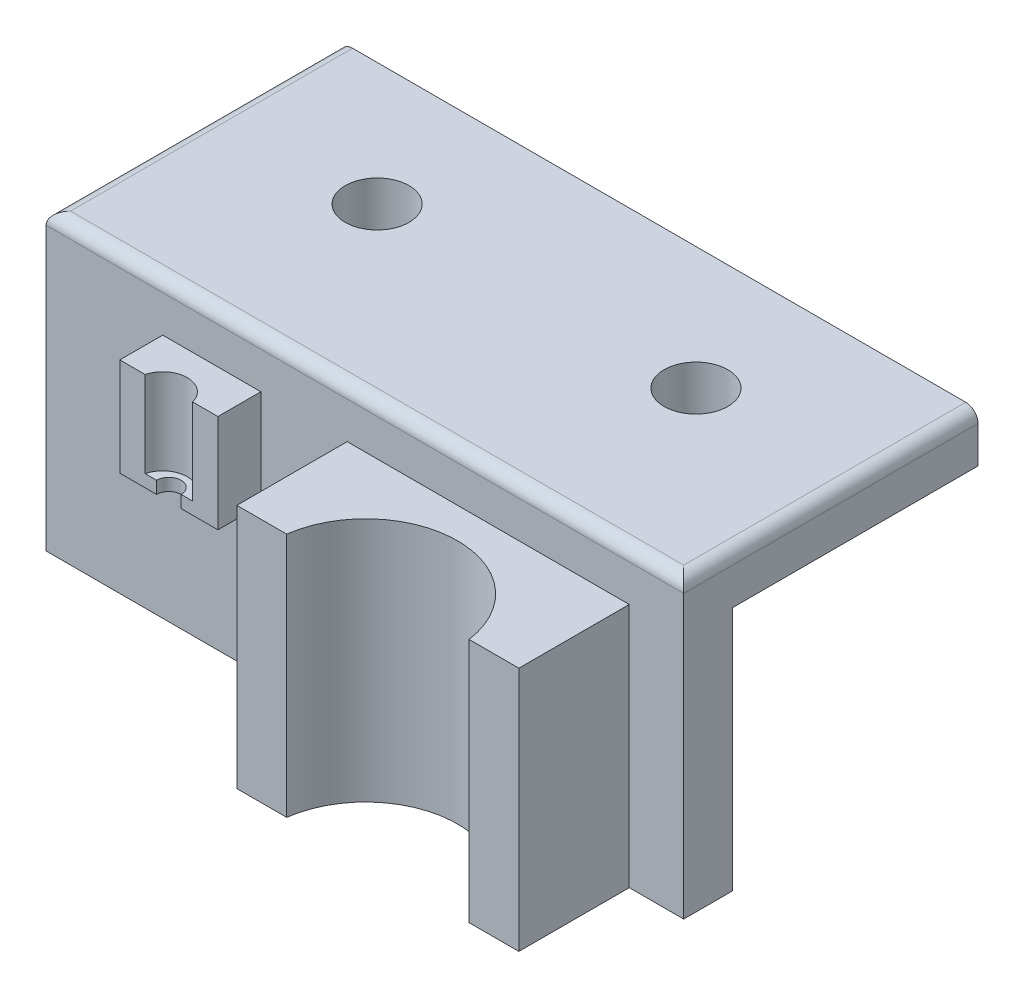
ISO-10303-21;
HEADER;
FILE_DESCRIPTION(('STEP AP214'),'2;1');
FILE_NAME('part.step','',(''),(''),'','','');
FILE_SCHEMA(('AUTOMOTIVE_DESIGN { 1 0 10303 214 1 1 1 1 }'));
ENDSEC;
DATA;
#1=APPLICATION_CONTEXT('core data for automotive mechanical design processes');
#2=APPLICATION_PROTOCOL_DEFINITION('international standard','automotive_design',2000,#1);
#3=PRODUCT_CONTEXT('',#1,'mechanical');
#4=PRODUCT('Part','Part','',(#3));
#5=PRODUCT_RELATED_PRODUCT_CATEGORY('part','',(#4));
#6=PRODUCT_DEFINITION_FORMATION('','',#4);
#7=PRODUCT_DEFINITION_CONTEXT('part definition',#1,'design');
#8=PRODUCT_DEFINITION('design','',#6,#7);
#9=PRODUCT_DEFINITION_SHAPE('','',#8);
#10=(LENGTH_UNIT() NAMED_UNIT(*) SI_UNIT(.MILLI.,.METRE.));
#11=(NAMED_UNIT(*) PLANE_ANGLE_UNIT() SI_UNIT($,.RADIAN.));
#12=(NAMED_UNIT(*) SI_UNIT($,.STERADIAN.) SOLID_ANGLE_UNIT());
#13=UNCERTAINTY_MEASURE_WITH_UNIT(LENGTH_MEASURE(1.E-05),#10,'distance_accuracy_value','');
#14=(GEOMETRIC_REPRESENTATION_CONTEXT(3) GLOBAL_UNCERTAINTY_ASSIGNED_CONTEXT((#13)) GLOBAL_UNIT_ASSIGNED_CONTEXT((#10,
#11,#12)) REPRESENTATION_CONTEXT('',''));
#15=CARTESIAN_POINT('',(0.,0.,0.));
#16=DIRECTION('',(0.,0.,1.));
#17=DIRECTION('',(1.,0.,0.));
#18=AXIS2_PLACEMENT_3D('',#15,#16,#17);
#19=CARTESIAN_POINT('',(-6.53464254801995,-28.6631016042781,7.5));
#20=DIRECTION('',(0.,0.,-1.));
#21=DIRECTION('',(-1.,0.,0.));
#22=AXIS2_PLACEMENT_3D('',#19,#20,#21);
#23=PLANE('',#22);
#24=DIRECTION('',(-1.,0.,0.));
#25=VECTOR('',#24,1.);
#26=CARTESIAN_POINT('',(-6.53464254801995,11.3368983957219,7.5));
#27=LINE('',#26,#25);
#28=CARTESIAN_POINT('',(-6.53464254801995,11.3368983957219,7.5));
#29=VERTEX_POINT('',#28);
#30=CARTESIAN_POINT('',(-8.59815087491624,11.3368983957219,7.5));
#31=VERTEX_POINT('',#30);
#32=EDGE_CURVE('E366',#29,#31,#27,.T.);
#33=ORIENTED_EDGE('',*,*,#32,.T.);
#34=DIRECTION('',(0.,1.,0.));
#35=VECTOR('',#34,1.);
#36=CARTESIAN_POINT('',(-8.59815087491624,4.33689839572192,7.5));
#37=LINE('',#36,#35);
#38=CARTESIAN_POINT('',(-8.59815087491624,4.33689839572192,7.5));
#39=VERTEX_POINT('',#38);
#40=EDGE_CURVE('E445',#39,#31,#37,.T.);
#41=ORIENTED_EDGE('',*,*,#40,.F.);
#42=DIRECTION('',(-1.,0.,0.));
#43=VECTOR('',#42,1.);
#44=CARTESIAN_POINT('',(-10.5346425480199,4.33689839572192,7.5));
#45=LINE('',#44,#43);
#46=CARTESIAN_POINT('',(-9.53464254801995,4.33689839572192,7.5));
#47=VERTEX_POINT('',#46);
#48=EDGE_CURVE('E304',#39,#47,#45,.T.);
#49=ORIENTED_EDGE('',*,*,#48,.T.);
#50=DIRECTION('',(0.,-1.,0.));
#51=VECTOR('',#50,1.);
#52=CARTESIAN_POINT('',(-9.53464254801995,14.3368983957219,7.5));
#53=LINE('',#52,#51);
#54=CARTESIAN_POINT('',(-9.53464254801995,3.33689839572192,7.5));
#55=VERTEX_POINT('',#54);
#56=EDGE_CURVE('E329',#47,#55,#53,.T.);
#57=ORIENTED_EDGE('',*,*,#56,.T.);
#58=DIRECTION('',(-1.,0.,0.));
#59=VECTOR('',#58,1.);
#60=CARTESIAN_POINT('',(0.,3.33689839572192,7.5));
#61=LINE('',#60,#59);
#62=CARTESIAN_POINT('',(-6.53464254801995,3.33689839572193,7.5));
#63=VERTEX_POINT('',#62);
#64=EDGE_CURVE('E230',#63,#55,#61,.T.);
#65=ORIENTED_EDGE('',*,*,#64,.F.);
#66=DIRECTION('',(0.,1.,0.));
#67=VECTOR('',#66,1.);
#68=CARTESIAN_POINT('',(-6.53464254801995,-28.6631016042781,7.5));
#69=LINE('',#68,#67);
#70=EDGE_CURVE('E438',#63,#29,#69,.T.);
#71=ORIENTED_EDGE('',*,*,#70,.T.);
#72=EDGE_LOOP('',(#33,#41,#49,#57,#65,#71));
#73=FACE_BOUND('',#72,.T.);
#74=ADVANCED_FACE('F40',(#73),#23,.F.);
#75=CARTESIAN_POINT('',(23.5073612519356,15.3368983957219,14.));
#76=DIRECTION('',(-1.,0.,0.));
#77=DIRECTION('',(0.,-1.,0.));
#78=AXIS2_PLACEMENT_3D('',#75,#76,#77);
#79=PLANE('',#78);
#80=DIRECTION('',(0.,0.,-1.));
#81=VECTOR('',#80,1.);
#82=CARTESIAN_POINT('',(23.5073612519356,11.3368983957219,14.));
#83=LINE('',#82,#81);
#84=CARTESIAN_POINT('',(23.5073612519356,11.3368983957219,13.));
#85=VERTEX_POINT('',#84);
#86=CARTESIAN_POINT('',(23.5073612519356,11.3368983957219,4.));
#87=VERTEX_POINT('',#86);
#88=EDGE_CURVE('E197',#85,#87,#83,.T.);
#89=ORIENTED_EDGE('',*,*,#88,.F.);
#90=DIRECTION('',(0.,1.,0.));
#91=VECTOR('',#90,1.);
#92=CARTESIAN_POINT('',(23.5073612519356,-28.6631016042781,13.));
#93=LINE('',#92,#91);
#94=CARTESIAN_POINT('',(23.5073612519356,-8.66617201959453,13.));
#95=VERTEX_POINT('',#94);
#96=EDGE_CURVE('E325',#95,#85,#93,.T.);
#97=ORIENTED_EDGE('',*,*,#96,.F.);
#98=DIRECTION('',(0.,0.,1.));
#99=VECTOR('',#98,1.);
#100=CARTESIAN_POINT('',(23.5073612519356,-8.66617201959453,4.));
#101=LINE('',#100,#99);
#102=CARTESIAN_POINT('',(23.5073612519356,-8.66617201959453,4.));
#103=VERTEX_POINT('',#102);
#104=EDGE_CURVE('E395',#103,#95,#101,.T.);
#105=ORIENTED_EDGE('',*,*,#104,.F.);
#106=DIRECTION('',(0.,1.,0.));
#107=VECTOR('',#106,1.);
#108=CARTESIAN_POINT('',(23.5073612519356,15.3368983957219,4.));
#109=LINE('',#108,#107);
#110=CARTESIAN_POINT('',(23.5073612519356,-8.66310160427808,4.));
#111=VERTEX_POINT('',#110);
#112=EDGE_CURVE('E227',#103,#111,#109,.T.);
#113=ORIENTED_EDGE('',*,*,#112,.T.);
#114=EDGE_CURVE('E217',#111,#87,#109,.T.);
#115=ORIENTED_EDGE('',*,*,#114,.T.);
#116=EDGE_LOOP('',(#89,#97,#105,#113,#115));
#117=FACE_BOUND('',#116,.T.);
#118=ADVANCED_FACE('F224',(#117),#79,.F.);
#119=CARTESIAN_POINT('',(0.507361251935578,15.3368983957219,14.));
#120=DIRECTION('',(1.,0.,0.));
#121=DIRECTION('',(0.,1.,0.));
#122=AXIS2_PLACEMENT_3D('',#119,#120,#121);
#123=PLANE('',#122);
#124=DIRECTION('',(0.,0.,-1.));
#125=VECTOR('',#124,1.);
#126=CARTESIAN_POINT('',(0.507361251935578,11.3368983957219,14.));
#127=LINE('',#126,#125);
#128=CARTESIAN_POINT('',(0.507361251935578,11.3368983957219,13.));
#129=VERTEX_POINT('',#128);
#130=CARTESIAN_POINT('',(0.507361251935578,11.3368983957219,4.));
#131=VERTEX_POINT('',#130);
#132=EDGE_CURVE('E209',#129,#131,#127,.T.);
#133=ORIENTED_EDGE('',*,*,#132,.T.);
#134=DIRECTION('',(0.,-1.,0.));
#135=VECTOR('',#134,1.);
#136=CARTESIAN_POINT('',(0.507361251935578,15.3368983957219,4.));
#137=LINE('',#136,#135);
#138=CARTESIAN_POINT('',(0.507361251935581,-8.66310160427808,4.));
#139=VERTEX_POINT('',#138);
#140=EDGE_CURVE('E219',#131,#139,#137,.T.);
#141=ORIENTED_EDGE('',*,*,#140,.T.);
#142=CARTESIAN_POINT('',(0.507361251935581,-8.66617201959453,4.));
#143=VERTEX_POINT('',#142);
#144=EDGE_CURVE('E234',#139,#143,#137,.T.);
#145=ORIENTED_EDGE('',*,*,#144,.T.);
#146=DIRECTION('',(0.,0.,-1.));
#147=VECTOR('',#146,1.);
#148=CARTESIAN_POINT('',(0.507361251935578,-8.66617201959453,13.));
#149=LINE('',#148,#147);
#150=CARTESIAN_POINT('',(0.507361251935578,-8.66617201959453,13.));
#151=VERTEX_POINT('',#150);
#152=EDGE_CURVE('E408',#151,#143,#149,.T.);
#153=ORIENTED_EDGE('',*,*,#152,.F.);
#154=DIRECTION('',(0.,1.,0.));
#155=VECTOR('',#154,1.);
#156=CARTESIAN_POINT('',(0.507361251935578,-28.6631016042781,13.));
#157=LINE('',#156,#155);
#158=EDGE_CURVE('E434',#151,#129,#157,.T.);
#159=ORIENTED_EDGE('',*,*,#158,.T.);
#160=EDGE_LOOP('',(#133,#141,#145,#153,#159));
#161=FACE_BOUND('',#160,.T.);
#162=ADVANCED_FACE('F497',(#161),#123,.F.);
#163=CARTESIAN_POINT('',(12.0073612519356,15.3368983957219,14.));
#164=DIRECTION('',(0.,-1.,0.));
#165=DIRECTION('',(0.,0.,-1.));
#166=AXIS2_PLACEMENT_3D('',#163,#164,#165);
#167=CYLINDRICAL_SURFACE('',#166,7.5);
#168=CARTESIAN_POINT('',(12.0073612519356,11.3368983957219,14.));
#169=DIRECTION('',(0.,-1.,0.));
#170=DIRECTION('',(0.,0.,-1.));
#171=AXIS2_PLACEMENT_3D('',#168,#169,#170);
#172=CIRCLE('',#171,7.5);
#173=CARTESIAN_POINT('',(4.57432687827633,11.3368983957219,13.));
#174=VERTEX_POINT('',#173);
#175=CARTESIAN_POINT('',(19.4403956255948,11.3368983957219,13.));
#176=VERTEX_POINT('',#175);
#177=EDGE_CURVE('E222',#174,#176,#172,.T.);
#178=ORIENTED_EDGE('',*,*,#177,.F.);
#179=DIRECTION('',(0.,-1.,0.));
#180=VECTOR('',#179,1.);
#181=CARTESIAN_POINT('',(4.57432687827633,15.3368983957219,13.));
#182=LINE('',#181,#180);
#183=CARTESIAN_POINT('',(4.57432687827633,-8.66617201959453,13.));
#184=VERTEX_POINT('',#183);
#185=EDGE_CURVE('E308',#174,#184,#182,.T.);
#186=ORIENTED_EDGE('',*,*,#185,.T.);
#187=CARTESIAN_POINT('',(12.0073612519356,-8.66617201959453,14.));
#188=DIRECTION('',(0.,1.,0.));
#189=DIRECTION('',(0.,0.,-1.));
#190=AXIS2_PLACEMENT_3D('',#187,#188,#189);
#191=CIRCLE('',#190,7.5);
#192=CARTESIAN_POINT('',(19.4403956255948,-8.66617201959453,13.));
#193=VERTEX_POINT('',#192);
#194=EDGE_CURVE('E401',#193,#184,#191,.T.);
#195=ORIENTED_EDGE('',*,*,#194,.F.);
#196=DIRECTION('',(0.,-1.,0.));
#197=VECTOR('',#196,1.);
#198=CARTESIAN_POINT('',(19.4403956255948,15.3368983957219,13.));
#199=LINE('',#198,#197);
#200=EDGE_CURVE('E311',#193,#176,#199,.F.);
#201=ORIENTED_EDGE('',*,*,#200,.T.);
#202=EDGE_LOOP('',(#178,#186,#195,#201));
#203=FACE_BOUND('',#202,.T.);
#204=ADVANCED_FACE('F491',(#203),#167,.F.);
#205=CARTESIAN_POINT('',(23.5073612519356,-28.6631016042781,13.));
#206=DIRECTION('',(0.,0.,-1.));
#207=DIRECTION('',(-1.,0.,0.));
#208=AXIS2_PLACEMENT_3D('',#205,#206,#207);
#209=PLANE('',#208);
#210=DIRECTION('',(-1.,0.,0.));
#211=VECTOR('',#210,1.);
#212=CARTESIAN_POINT('',(23.5073612519356,11.3368983957219,13.));
#213=LINE('',#212,#211);
#214=EDGE_CURVE('E475',#174,#129,#213,.T.);
#215=ORIENTED_EDGE('',*,*,#214,.T.);
#216=ORIENTED_EDGE('',*,*,#158,.F.);
#217=DIRECTION('',(-1.,0.,0.));
#218=VECTOR('',#217,1.);
#219=CARTESIAN_POINT('',(4.57432687827633,-8.66617201959453,13.));
#220=LINE('',#219,#218);
#221=EDGE_CURVE('E405',#184,#151,#220,.T.);
#222=ORIENTED_EDGE('',*,*,#221,.F.);
#223=ORIENTED_EDGE('',*,*,#185,.F.);
#224=EDGE_LOOP('',(#215,#216,#222,#223));
#225=FACE_BOUND('',#224,.T.);
#226=ADVANCED_FACE('F496',(#225),#209,.F.);
#227=EDGE_CURVE('E203',#85,#176,#213,.T.);
#228=ORIENTED_EDGE('',*,*,#227,.T.);
#229=ORIENTED_EDGE('',*,*,#200,.F.);
#230=DIRECTION('',(-1.,0.,0.));
#231=VECTOR('',#230,1.);
#232=CARTESIAN_POINT('',(23.5073612519356,-8.66617201959453,13.));
#233=LINE('',#232,#231);
#234=EDGE_CURVE('E398',#95,#193,#233,.T.);
#235=ORIENTED_EDGE('',*,*,#234,.F.);
#236=ORIENTED_EDGE('',*,*,#96,.T.);
#237=EDGE_LOOP('',(#228,#229,#235,#236));
#238=FACE_BOUND('',#237,.T.);
#239=ADVANCED_FACE('F488',(#238),#209,.F.);
#240=CARTESIAN_POINT('',(0.,15.3368983957219,0.));
#241=DIRECTION('',(0.,1.,0.));
#242=DIRECTION('',(0.,0.,1.));
#243=AXIS2_PLACEMENT_3D('',#240,#241,#242);
#244=PLANE('',#243);
#245=CARTESIAN_POINT('',(-11.0534759358289,15.3368983957219,-10.));
#246=DIRECTION('',(0.,1.,0.));
#247=DIRECTION('',(0.,0.,1.));
#248=AXIS2_PLACEMENT_3D('',#245,#246,#247);
#249=CIRCLE('',#248,2.6);
#250=CARTESIAN_POINT('',(-11.0534759358289,15.3368983957219,-7.4));
#251=VERTEX_POINT('',#250);
#252=EDGE_CURVE('E321',#251,#251,#249,.T.);
#253=ORIENTED_EDGE('',*,*,#252,.F.);
#254=EDGE_LOOP('',(#253));
#255=FACE_BOUND('',#254,.T.);
#256=CARTESIAN_POINT('',(14.9465240641711,15.3368983957219,-10.));
#257=DIRECTION('',(0.,1.,0.));
#258=DIRECTION('',(0.,0.,1.));
#259=AXIS2_PLACEMENT_3D('',#256,#257,#258);
#260=CIRCLE('',#259,2.6);
#261=CARTESIAN_POINT('',(14.9465240641711,15.3368983957219,-7.4));
#262=VERTEX_POINT('',#261);
#263=EDGE_CURVE('E426',#262,#262,#260,.T.);
#264=ORIENTED_EDGE('',*,*,#263,.F.);
#265=EDGE_LOOP('',(#264));
#266=FACE_BOUND('',#265,.T.);
#267=DIRECTION('',(1.,0.,0.));
#268=VECTOR('',#267,1.);
#269=CARTESIAN_POINT('',(19.9465240641711,15.3368983957219,-20.));
#270=LINE('',#269,#268);
#271=CARTESIAN_POINT('',(-23.0534759358289,15.3368983957219,-20.));
#272=VERTEX_POINT('',#271);
#273=CARTESIAN_POINT('',(26.9465240641711,15.3368983957219,-20.));
#274=VERTEX_POINT('',#273);
#275=EDGE_CURVE('E297',#272,#274,#270,.T.);
#276=ORIENTED_EDGE('',*,*,#275,.F.);
#277=DIRECTION('',(0.,0.,-1.));
#278=VECTOR('',#277,1.);
#279=CARTESIAN_POINT('',(-23.0534759358289,15.3368983957219,0.));
#280=LINE('',#279,#278);
#281=CARTESIAN_POINT('',(-23.0534759358289,15.3368983957219,3.));
#282=VERTEX_POINT('',#281);
#283=EDGE_CURVE('E64',#272,#282,#280,.F.);
#284=ORIENTED_EDGE('',*,*,#283,.T.);
#285=DIRECTION('',(1.,0.,0.));
#286=VECTOR('',#285,1.);
#287=CARTESIAN_POINT('',(0.,15.3368983957219,3.));
#288=LINE('',#287,#286);
#289=CARTESIAN_POINT('',(26.9465240641711,15.3368983957219,3.));
#290=VERTEX_POINT('',#289);
#291=EDGE_CURVE('E346',#282,#290,#288,.T.);
#292=ORIENTED_EDGE('',*,*,#291,.T.);
#293=DIRECTION('',(0.,0.,1.));
#294=VECTOR('',#293,1.);
#295=CARTESIAN_POINT('',(26.9465240641711,15.3368983957219,0.));
#296=LINE('',#295,#294);
#297=EDGE_CURVE('E343',#290,#274,#296,.F.);
#298=ORIENTED_EDGE('',*,*,#297,.T.);
#299=EDGE_LOOP('',(#276,#284,#292,#298));
#300=FACE_BOUND('',#299,.T.);
#301=ADVANCED_FACE('F574',(#255,#266,#300),#244,.T.);
#302=CARTESIAN_POINT('',(-14.5346425480199,0.,8.));
#303=DIRECTION('',(1.,0.,0.));
#304=DIRECTION('',(0.,1.,0.));
#305=AXIS2_PLACEMENT_3D('',#302,#303,#304);
#306=PLANE('',#305);
#307=DIRECTION('',(0.,0.,-1.));
#308=VECTOR('',#307,1.);
#309=CARTESIAN_POINT('',(-14.5346425480199,11.3368983957219,8.));
#310=LINE('',#309,#308);
#311=CARTESIAN_POINT('',(-14.5346425480199,11.3368983957219,7.5));
#312=VERTEX_POINT('',#311);
#313=CARTESIAN_POINT('',(-14.5346425480199,11.3368983957219,4.));
#314=VERTEX_POINT('',#313);
#315=EDGE_CURVE('E383',#312,#314,#310,.T.);
#316=ORIENTED_EDGE('',*,*,#315,.T.);
#317=DIRECTION('',(0.,-1.,0.));
#318=VECTOR('',#317,1.);
#319=CARTESIAN_POINT('',(-14.5346425480199,0.,4.));
#320=LINE('',#319,#318);
#321=CARTESIAN_POINT('',(-14.5346425480199,3.33689839572192,4.));
#322=VERTEX_POINT('',#321);
#323=EDGE_CURVE('E274',#314,#322,#320,.T.);
#324=ORIENTED_EDGE('',*,*,#323,.T.);
#325=DIRECTION('',(0.,0.,-1.));
#326=VECTOR('',#325,1.);
#327=CARTESIAN_POINT('',(-14.5346425480199,3.33689839572192,8.));
#328=LINE('',#327,#326);
#329=CARTESIAN_POINT('',(-14.5346425480199,3.33689839572193,7.5));
#330=VERTEX_POINT('',#329);
#331=EDGE_CURVE('E288',#330,#322,#328,.T.);
#332=ORIENTED_EDGE('',*,*,#331,.F.);
#333=DIRECTION('',(0.,1.,0.));
#334=VECTOR('',#333,1.);
#335=CARTESIAN_POINT('',(-14.5346425480199,-28.6631016042781,7.5));
#336=LINE('',#335,#334);
#337=EDGE_CURVE('E441',#330,#312,#336,.T.);
#338=ORIENTED_EDGE('',*,*,#337,.T.);
#339=EDGE_LOOP('',(#316,#324,#332,#338));
#340=FACE_BOUND('',#339,.T.);
#341=ADVANCED_FACE('F469',(#340),#306,.F.);
#342=CARTESIAN_POINT('',(-6.53464254801994,0.,8.));
#343=DIRECTION('',(1.,0.,0.));
#344=DIRECTION('',(0.,1.,0.));
#345=AXIS2_PLACEMENT_3D('',#342,#343,#344);
#346=PLANE('',#345);
#347=DIRECTION('',(0.,-1.,0.));
#348=VECTOR('',#347,1.);
#349=CARTESIAN_POINT('',(-6.53464254801994,0.,4.));
#350=LINE('',#349,#348);
#351=CARTESIAN_POINT('',(-6.53464254801994,11.3368983957219,4.));
#352=VERTEX_POINT('',#351);
#353=CARTESIAN_POINT('',(-6.53464254801994,3.33689839572192,4.));
#354=VERTEX_POINT('',#353);
#355=EDGE_CURVE('E281',#352,#354,#350,.T.);
#356=ORIENTED_EDGE('',*,*,#355,.F.);
#357=DIRECTION('',(0.,0.,-1.));
#358=VECTOR('',#357,1.);
#359=CARTESIAN_POINT('',(-6.53464254801995,11.3368983957219,8.));
#360=LINE('',#359,#358);
#361=EDGE_CURVE('E360',#29,#352,#360,.T.);
#362=ORIENTED_EDGE('',*,*,#361,.F.);
#363=ORIENTED_EDGE('',*,*,#70,.F.);
#364=DIRECTION('',(0.,0.,-1.));
#365=VECTOR('',#364,1.);
#366=CARTESIAN_POINT('',(-6.53464254801994,3.33689839572192,8.));
#367=LINE('',#366,#365);
#368=EDGE_CURVE('E284',#63,#354,#367,.T.);
#369=ORIENTED_EDGE('',*,*,#368,.T.);
#370=EDGE_LOOP('',(#356,#362,#363,#369));
#371=FACE_BOUND('',#370,.T.);
#372=ADVANCED_FACE('F560',(#371),#346,.T.);
#373=CARTESIAN_POINT('',(-10.5346425480199,4.33689839572192,8.));
#374=DIRECTION('',(0.,1.,0.));
#375=DIRECTION('',(0.,0.,1.));
#376=AXIS2_PLACEMENT_3D('',#373,#374,#375);
#377=CYLINDRICAL_SURFACE('',#376,2.);
#378=CARTESIAN_POINT('',(-10.5346425480199,11.3368983957219,8.));
#379=DIRECTION('',(0.,1.,0.));
#380=DIRECTION('',(0.,0.,1.));
#381=AXIS2_PLACEMENT_3D('',#378,#379,#380);
#382=CIRCLE('',#381,2.);
#383=CARTESIAN_POINT('',(-12.4711342211237,11.3368983957219,7.5));
#384=VERTEX_POINT('',#383);
#385=EDGE_CURVE('E373',#31,#384,#382,.T.);
#386=ORIENTED_EDGE('',*,*,#385,.T.);
#387=DIRECTION('',(0.,1.,0.));
#388=VECTOR('',#387,1.);
#389=CARTESIAN_POINT('',(-12.4711342211237,4.33689839572192,7.5));
#390=LINE('',#389,#388);
#391=CARTESIAN_POINT('',(-12.4711342211237,4.33689839572192,7.5));
#392=VERTEX_POINT('',#391);
#393=EDGE_CURVE('E451',#384,#392,#390,.F.);
#394=ORIENTED_EDGE('',*,*,#393,.T.);
#395=CARTESIAN_POINT('',(-10.5346425480199,4.33689839572192,8.));
#396=DIRECTION('',(0.,1.,0.));
#397=DIRECTION('',(0.,0.,1.));
#398=AXIS2_PLACEMENT_3D('',#395,#396,#397);
#399=CIRCLE('',#398,2.);
#400=EDGE_CURVE('E270',#39,#392,#399,.T.);
#401=ORIENTED_EDGE('',*,*,#400,.F.);
#402=ORIENTED_EDGE('',*,*,#40,.T.);
#403=EDGE_LOOP('',(#386,#394,#401,#402));
#404=FACE_BOUND('',#403,.T.);
#405=ADVANCED_FACE('F553',(#404),#377,.F.);
#406=EDGE_CURVE('E375',#384,#312,#27,.T.);
#407=ORIENTED_EDGE('',*,*,#406,.T.);
#408=ORIENTED_EDGE('',*,*,#337,.F.);
#409=CARTESIAN_POINT('',(-11.5346425480199,3.33689839572192,7.5));
#410=VERTEX_POINT('',#409);
#411=EDGE_CURVE('E236',#410,#330,#61,.T.);
#412=ORIENTED_EDGE('',*,*,#411,.F.);
#413=DIRECTION('',(0.,-1.,0.));
#414=VECTOR('',#413,1.);
#415=CARTESIAN_POINT('',(-11.5346425480199,14.3368983957219,7.5));
#416=LINE('',#415,#414);
#417=CARTESIAN_POINT('',(-11.5346425480199,4.33689839572192,7.5));
#418=VERTEX_POINT('',#417);
#419=EDGE_CURVE('E315',#410,#418,#416,.F.);
#420=ORIENTED_EDGE('',*,*,#419,.T.);
#421=EDGE_CURVE('E301',#418,#392,#45,.T.);
#422=ORIENTED_EDGE('',*,*,#421,.T.);
#423=ORIENTED_EDGE('',*,*,#393,.F.);
#424=EDGE_LOOP('',(#407,#408,#412,#420,#422,#423));
#425=FACE_BOUND('',#424,.T.);
#426=ADVANCED_FACE('F465',(#425),#23,.F.);
#427=CARTESIAN_POINT('',(27.9465240641711,-8.66310160427808,4.));
#428=DIRECTION('',(0.,0.,1.));
#429=DIRECTION('',(1.,0.,0.));
#430=AXIS2_PLACEMENT_3D('',#427,#428,#429);
#431=PLANE('',#430);
#432=DIRECTION('',(1.,0.,0.));
#433=VECTOR('',#432,1.);
#434=CARTESIAN_POINT('',(0.507361251935581,-8.66617201959453,4.));
#435=LINE('',#434,#433);
#436=EDGE_CURVE('E392',#143,#103,#435,.T.);
#437=ORIENTED_EDGE('',*,*,#436,.F.);
#438=ORIENTED_EDGE('',*,*,#144,.F.);
#439=DIRECTION('',(-1.,0.,0.));
#440=VECTOR('',#439,1.);
#441=CARTESIAN_POINT('',(27.9465240641711,-8.66310160427808,4.));
#442=LINE('',#441,#440);
#443=EDGE_CURVE('E427',#111,#139,#442,.T.);
#444=ORIENTED_EDGE('',*,*,#443,.F.);
#445=ORIENTED_EDGE('',*,*,#112,.F.);
#446=EDGE_LOOP('',(#437,#438,#444,#445));
#447=FACE_BOUND('',#446,.T.);
#448=ADVANCED_FACE('F502',(#447),#431,.F.);
#449=CARTESIAN_POINT('',(0.,0.,4.));
#450=DIRECTION('',(0.,0.,1.));
#451=DIRECTION('',(1.,0.,0.));
#452=AXIS2_PLACEMENT_3D('',#449,#450,#451);
#453=PLANE('',#452);
#454=DIRECTION('',(0.,-1.,0.));
#455=VECTOR('',#454,1.);
#456=CARTESIAN_POINT('',(27.9465240641711,15.3368983957219,4.));
#457=LINE('',#456,#455);
#458=CARTESIAN_POINT('',(27.9465240641711,14.3368983957219,4.));
#459=VERTEX_POINT('',#458);
#460=CARTESIAN_POINT('',(27.9465240641711,-8.66310160427808,4.));
#461=VERTEX_POINT('',#460);
#462=EDGE_CURVE('E242',#459,#461,#457,.T.);
#463=ORIENTED_EDGE('',*,*,#462,.F.);
#464=DIRECTION('',(1.,0.,0.));
#465=VECTOR('',#464,1.);
#466=CARTESIAN_POINT('',(0.,14.3368983957219,4.));
#467=LINE('',#466,#465);
#468=CARTESIAN_POINT('',(-24.0534759358289,14.3368983957219,4.));
#469=VERTEX_POINT('',#468);
#470=EDGE_CURVE('E50',#459,#469,#467,.F.);
#471=ORIENTED_EDGE('',*,*,#470,.T.);
#472=DIRECTION('',(0.,1.,0.));
#473=VECTOR('',#472,1.);
#474=CARTESIAN_POINT('',(-24.0534759358289,-28.6631016042781,4.));
#475=LINE('',#474,#473);
#476=CARTESIAN_POINT('',(-24.0534759358289,-8.66310160427808,4.));
#477=VERTEX_POINT('',#476);
#478=EDGE_CURVE('E255',#477,#469,#475,.T.);
#479=ORIENTED_EDGE('',*,*,#478,.F.);
#480=EDGE_CURVE('E421',#139,#477,#442,.T.);
#481=ORIENTED_EDGE('',*,*,#480,.F.);
#482=ORIENTED_EDGE('',*,*,#140,.F.);
#483=DIRECTION('',(-1.,0.,0.));
#484=VECTOR('',#483,1.);
#485=CARTESIAN_POINT('',(27.9465240641711,11.3368983957219,4.));
#486=LINE('',#485,#484);
#487=EDGE_CURVE('E200',#87,#131,#486,.T.);
#488=ORIENTED_EDGE('',*,*,#487,.F.);
#489=ORIENTED_EDGE('',*,*,#114,.F.);
#490=EDGE_CURVE('E422',#461,#111,#442,.T.);
#491=ORIENTED_EDGE('',*,*,#490,.F.);
#492=EDGE_LOOP('',(#463,#471,#479,#481,#482,#488,#489,#491));
#493=FACE_BOUND('',#492,.T.);
#494=EDGE_CURVE('E221',#352,#314,#486,.T.);
#495=ORIENTED_EDGE('',*,*,#494,.F.);
#496=ORIENTED_EDGE('',*,*,#355,.T.);
#497=DIRECTION('',(1.,0.,0.));
#498=VECTOR('',#497,1.);
#499=CARTESIAN_POINT('',(0.,3.33689839572192,4.));
#500=LINE('',#499,#498);
#501=EDGE_CURVE('E277',#322,#354,#500,.T.);
#502=ORIENTED_EDGE('',*,*,#501,.F.);
#503=ORIENTED_EDGE('',*,*,#323,.F.);
#504=EDGE_LOOP('',(#495,#496,#502,#503));
#505=FACE_BOUND('',#504,.T.);
#506=ADVANCED_FACE('F214',(#493,#505),#453,.T.);
#507=CARTESIAN_POINT('',(0.,0.,0.));
#508=DIRECTION('',(0.,0.,1.));
#509=DIRECTION('',(1.,0.,0.));
#510=AXIS2_PLACEMENT_3D('',#507,#508,#509);
#511=PLANE('',#510);
#512=DIRECTION('',(1.,0.,0.));
#513=VECTOR('',#512,1.);
#514=CARTESIAN_POINT('',(-24.0534759358289,-8.66310160427808,0.));
#515=LINE('',#514,#513);
#516=CARTESIAN_POINT('',(-24.0534759358289,-8.66310160427808,0.));
#517=VERTEX_POINT('',#516);
#518=CARTESIAN_POINT('',(27.9465240641711,-8.66310160427808,0.));
#519=VERTEX_POINT('',#518);
#520=EDGE_CURVE('E414',#517,#519,#515,.T.);
#521=ORIENTED_EDGE('',*,*,#520,.F.);
#522=DIRECTION('',(0.,-1.,0.));
#523=VECTOR('',#522,1.);
#524=CARTESIAN_POINT('',(-24.0534759358289,11.3368983957219,0.));
#525=LINE('',#524,#523);
#526=CARTESIAN_POINT('',(-24.0534759358289,11.3368983957219,0.));
#527=VERTEX_POINT('',#526);
#528=EDGE_CURVE('E266',#527,#517,#525,.T.);
#529=ORIENTED_EDGE('',*,*,#528,.F.);
#530=DIRECTION('',(-1.,0.,0.));
#531=VECTOR('',#530,1.);
#532=CARTESIAN_POINT('',(19.9465240641711,11.3368983957219,0.));
#533=LINE('',#532,#531);
#534=CARTESIAN_POINT('',(27.9465240641711,11.3368983957219,0.));
#535=VERTEX_POINT('',#534);
#536=EDGE_CURVE('E292',#535,#527,#533,.T.);
#537=ORIENTED_EDGE('',*,*,#536,.F.);
#538=DIRECTION('',(0.,1.,0.));
#539=VECTOR('',#538,1.);
#540=CARTESIAN_POINT('',(27.9465240641711,-28.6631016042781,0.));
#541=LINE('',#540,#539);
#542=EDGE_CURVE('E245',#519,#535,#541,.T.);
#543=ORIENTED_EDGE('',*,*,#542,.F.);
#544=EDGE_LOOP('',(#521,#529,#537,#543));
#545=FACE_BOUND('',#544,.T.);
#546=ADVANCED_FACE('F529',(#545),#511,.F.);
#547=CARTESIAN_POINT('',(-24.0534759358289,0.,0.));
#548=DIRECTION('',(-1.,0.,0.));
#549=DIRECTION('',(0.,-1.,0.));
#550=AXIS2_PLACEMENT_3D('',#547,#548,#549);
#551=PLANE('',#550);
#552=ORIENTED_EDGE('',*,*,#478,.T.);
#553=DIRECTION('',(0.,0.,-1.));
#554=VECTOR('',#553,1.);
#555=CARTESIAN_POINT('',(-24.0534759358289,14.3368983957219,0.));
#556=LINE('',#555,#554);
#557=CARTESIAN_POINT('',(-24.0534759358289,14.3368983957219,-20.));
#558=VERTEX_POINT('',#557);
#559=EDGE_CURVE('E333',#469,#558,#556,.T.);
#560=ORIENTED_EDGE('',*,*,#559,.T.);
#561=DIRECTION('',(0.,-1.,0.));
#562=VECTOR('',#561,1.);
#563=CARTESIAN_POINT('',(-24.0534759358289,15.3368983957219,-20.));
#564=LINE('',#563,#562);
#565=CARTESIAN_POINT('',(-24.0534759358289,11.3368983957219,-20.));
#566=VERTEX_POINT('',#565);
#567=EDGE_CURVE('E259',#558,#566,#564,.T.);
#568=ORIENTED_EDGE('',*,*,#567,.T.);
#569=DIRECTION('',(0.,0.,1.));
#570=VECTOR('',#569,1.);
#571=CARTESIAN_POINT('',(-24.0534759358289,11.3368983957219,-20.));
#572=LINE('',#571,#570);
#573=EDGE_CURVE('E262',#566,#527,#572,.T.);
#574=ORIENTED_EDGE('',*,*,#573,.T.);
#575=ORIENTED_EDGE('',*,*,#528,.T.);
#576=DIRECTION('',(0.,0.,-1.));
#577=VECTOR('',#576,1.);
#578=CARTESIAN_POINT('',(-24.0534759358289,-8.66310160427808,4.));
#579=LINE('',#578,#577);
#580=EDGE_CURVE('E411',#477,#517,#579,.T.);
#581=ORIENTED_EDGE('',*,*,#580,.F.);
#582=EDGE_LOOP('',(#552,#560,#568,#574,#575,#581));
#583=FACE_BOUND('',#582,.T.);
#584=ADVANCED_FACE('F516',(#583),#551,.T.);
#585=CARTESIAN_POINT('',(27.9465240641711,0.,0.));
#586=DIRECTION('',(1.,0.,0.));
#587=DIRECTION('',(0.,1.,0.));
#588=AXIS2_PLACEMENT_3D('',#585,#586,#587);
#589=PLANE('',#588);
#590=DIRECTION('',(0.,1.,0.));
#591=VECTOR('',#590,1.);
#592=CARTESIAN_POINT('',(27.9465240641711,11.3368983957219,-20.));
#593=LINE('',#592,#591);
#594=CARTESIAN_POINT('',(27.9465240641711,11.3368983957219,-20.));
#595=VERTEX_POINT('',#594);
#596=CARTESIAN_POINT('',(27.9465240641711,14.3368983957219,-20.));
#597=VERTEX_POINT('',#596);
#598=EDGE_CURVE('E252',#595,#597,#593,.T.);
#599=ORIENTED_EDGE('',*,*,#598,.T.);
#600=DIRECTION('',(0.,0.,1.));
#601=VECTOR('',#600,1.);
#602=CARTESIAN_POINT('',(27.9465240641711,14.3368983957219,0.));
#603=LINE('',#602,#601);
#604=EDGE_CURVE('E11',#597,#459,#603,.T.);
#605=ORIENTED_EDGE('',*,*,#604,.T.);
#606=ORIENTED_EDGE('',*,*,#462,.T.);
#607=DIRECTION('',(0.,0.,1.));
#608=VECTOR('',#607,1.);
#609=CARTESIAN_POINT('',(27.9465240641711,-8.66310160427808,0.));
#610=LINE('',#609,#608);
#611=EDGE_CURVE('E417',#519,#461,#610,.T.);
#612=ORIENTED_EDGE('',*,*,#611,.F.);
#613=ORIENTED_EDGE('',*,*,#542,.T.);
#614=DIRECTION('',(0.,0.,-1.));
#615=VECTOR('',#614,1.);
#616=CARTESIAN_POINT('',(27.9465240641711,11.3368983957219,0.));
#617=LINE('',#616,#615);
#618=EDGE_CURVE('E248',#535,#595,#617,.T.);
#619=ORIENTED_EDGE('',*,*,#618,.T.);
#620=EDGE_LOOP('',(#599,#605,#606,#612,#613,#619));
#621=FACE_BOUND('',#620,.T.);
#622=ADVANCED_FACE('F531',(#621),#589,.T.);
#623=CARTESIAN_POINT('',(19.9465240641711,11.3368983957219,-20.));
#624=DIRECTION('',(0.,1.,0.));
#625=DIRECTION('',(0.,0.,1.));
#626=AXIS2_PLACEMENT_3D('',#623,#624,#625);
#627=PLANE('',#626);
#628=CARTESIAN_POINT('',(-11.0534759358289,11.3368983957219,-10.));
#629=DIRECTION('',(0.,1.,0.));
#630=DIRECTION('',(0.,0.,1.));
#631=AXIS2_PLACEMENT_3D('',#628,#629,#630);
#632=CIRCLE('',#631,2.6);
#633=CARTESIAN_POINT('',(-11.0534759358289,11.3368983957219,-7.4));
#634=VERTEX_POINT('',#633);
#635=EDGE_CURVE('E320',#634,#634,#632,.T.);
#636=ORIENTED_EDGE('',*,*,#635,.T.);
#637=EDGE_LOOP('',(#636));
#638=FACE_BOUND('',#637,.T.);
#639=CARTESIAN_POINT('',(14.9465240641711,11.3368983957219,-10.));
#640=DIRECTION('',(0.,1.,0.));
#641=DIRECTION('',(0.,0.,1.));
#642=AXIS2_PLACEMENT_3D('',#639,#640,#641);
#643=CIRCLE('',#642,2.6);
#644=CARTESIAN_POINT('',(14.9465240641711,11.3368983957219,-7.4));
#645=VERTEX_POINT('',#644);
#646=EDGE_CURVE('E316',#645,#645,#643,.T.);
#647=ORIENTED_EDGE('',*,*,#646,.T.);
#648=EDGE_LOOP('',(#647));
#649=FACE_BOUND('',#648,.T.);
#650=ORIENTED_EDGE('',*,*,#536,.T.);
#651=ORIENTED_EDGE('',*,*,#573,.F.);
#652=DIRECTION('',(-1.,0.,0.));
#653=VECTOR('',#652,1.);
#654=CARTESIAN_POINT('',(19.9465240641711,11.3368983957219,-20.));
#655=LINE('',#654,#653);
#656=EDGE_CURVE('E293',#595,#566,#655,.T.);
#657=ORIENTED_EDGE('',*,*,#656,.F.);
#658=ORIENTED_EDGE('',*,*,#618,.F.);
#659=EDGE_LOOP('',(#650,#651,#657,#658));
#660=FACE_BOUND('',#659,.T.);
#661=ADVANCED_FACE('F524',(#638,#649,#660),#627,.F.);
#662=CARTESIAN_POINT('',(0.,0.,-20.));
#663=DIRECTION('',(0.,0.,1.));
#664=DIRECTION('',(1.,0.,0.));
#665=AXIS2_PLACEMENT_3D('',#662,#663,#664);
#666=PLANE('',#665);
#667=ORIENTED_EDGE('',*,*,#567,.F.);
#668=CARTESIAN_POINT('',(-23.0534759358289,14.3368983957219,-20.));
#669=DIRECTION('',(0.,0.,1.));
#670=DIRECTION('',(1.,0.,0.));
#671=AXIS2_PLACEMENT_3D('',#668,#669,#670);
#672=CIRCLE('',#671,1.);
#673=EDGE_CURVE('E340',#558,#272,#672,.F.);
#674=ORIENTED_EDGE('',*,*,#673,.T.);
#675=ORIENTED_EDGE('',*,*,#275,.T.);
#676=CARTESIAN_POINT('',(26.9465240641711,14.3368983957219,-20.));
#677=DIRECTION('',(0.,0.,1.));
#678=DIRECTION('',(1.,0.,0.));
#679=AXIS2_PLACEMENT_3D('',#676,#677,#678);
#680=CIRCLE('',#679,1.);
#681=EDGE_CURVE('E337',#274,#597,#680,.F.);
#682=ORIENTED_EDGE('',*,*,#681,.T.);
#683=ORIENTED_EDGE('',*,*,#598,.F.);
#684=ORIENTED_EDGE('',*,*,#656,.T.);
#685=EDGE_LOOP('',(#667,#674,#675,#682,#683,#684));
#686=FACE_BOUND('',#685,.T.);
#687=ADVANCED_FACE('F519',(#686),#666,.F.);
#688=CARTESIAN_POINT('',(0.,3.33689839572192,8.));
#689=DIRECTION('',(0.,1.,0.));
#690=DIRECTION('',(0.,0.,1.));
#691=AXIS2_PLACEMENT_3D('',#688,#689,#690);
#692=PLANE('',#691);
#693=ORIENTED_EDGE('',*,*,#64,.T.);
#694=CARTESIAN_POINT('',(-10.5346425480199,3.33689839572192,7.5));
#695=DIRECTION('',(0.,-1.,0.));
#696=DIRECTION('',(0.,0.,-1.));
#697=AXIS2_PLACEMENT_3D('',#694,#695,#696);
#698=CIRCLE('',#697,1.);
#699=EDGE_CURVE('E386',#410,#55,#698,.T.);
#700=ORIENTED_EDGE('',*,*,#699,.F.);
#701=ORIENTED_EDGE('',*,*,#411,.T.);
#702=ORIENTED_EDGE('',*,*,#331,.T.);
#703=ORIENTED_EDGE('',*,*,#501,.T.);
#704=ORIENTED_EDGE('',*,*,#368,.F.);
#705=EDGE_LOOP('',(#693,#700,#701,#702,#703,#704));
#706=FACE_BOUND('',#705,.T.);
#707=ADVANCED_FACE('F461',(#706),#692,.F.);
#708=CARTESIAN_POINT('',(-10.5346425480199,4.33689839572192,8.));
#709=DIRECTION('',(0.,1.,0.));
#710=DIRECTION('',(0.,0.,1.));
#711=AXIS2_PLACEMENT_3D('',#708,#709,#710);
#712=PLANE('',#711);
#713=CARTESIAN_POINT('',(-10.5346425480199,4.33689839572192,7.5));
#714=DIRECTION('',(0.,1.,0.));
#715=DIRECTION('',(0.,0.,1.));
#716=AXIS2_PLACEMENT_3D('',#713,#714,#715);
#717=CIRCLE('',#716,1.);
#718=EDGE_CURVE('E389',#47,#418,#717,.T.);
#719=ORIENTED_EDGE('',*,*,#718,.F.);
#720=ORIENTED_EDGE('',*,*,#48,.F.);
#721=ORIENTED_EDGE('',*,*,#400,.T.);
#722=ORIENTED_EDGE('',*,*,#421,.F.);
#723=EDGE_LOOP('',(#719,#720,#721,#722));
#724=FACE_BOUND('',#723,.T.);
#725=ADVANCED_FACE('F568',(#724),#712,.T.);
#726=CARTESIAN_POINT('',(14.9465240641711,8.33689839572192,-10.));
#727=DIRECTION('',(0.,1.,0.));
#728=DIRECTION('',(0.,0.,1.));
#729=AXIS2_PLACEMENT_3D('',#726,#727,#728);
#730=CYLINDRICAL_SURFACE('',#729,2.6);
#731=ORIENTED_EDGE('',*,*,#263,.T.);
#732=EDGE_LOOP('',(#731));
#733=FACE_BOUND('',#732,.T.);
#734=ORIENTED_EDGE('',*,*,#646,.F.);
#735=EDGE_LOOP('',(#734));
#736=FACE_BOUND('',#735,.T.);
#737=ADVANCED_FACE('F608',(#733,#736),#730,.F.);
#738=CARTESIAN_POINT('',(-11.0534759358289,8.33689839572192,-10.));
#739=DIRECTION('',(0.,1.,0.));
#740=DIRECTION('',(0.,0.,1.));
#741=AXIS2_PLACEMENT_3D('',#738,#739,#740);
#742=CYLINDRICAL_SURFACE('',#741,2.6);
#743=ORIENTED_EDGE('',*,*,#252,.T.);
#744=EDGE_LOOP('',(#743));
#745=FACE_BOUND('',#744,.T.);
#746=ORIENTED_EDGE('',*,*,#635,.F.);
#747=EDGE_LOOP('',(#746));
#748=FACE_BOUND('',#747,.T.);
#749=ADVANCED_FACE('F604',(#745,#748),#742,.F.);
#750=CARTESIAN_POINT('',(0.,-8.66310160427808,0.));
#751=DIRECTION('',(0.,-1.,0.));
#752=DIRECTION('',(0.,0.,-1.));
#753=AXIS2_PLACEMENT_3D('',#750,#751,#752);
#754=PLANE('',#753);
#755=ORIENTED_EDGE('',*,*,#580,.T.);
#756=ORIENTED_EDGE('',*,*,#520,.T.);
#757=ORIENTED_EDGE('',*,*,#611,.T.);
#758=ORIENTED_EDGE('',*,*,#490,.T.);
#759=ORIENTED_EDGE('',*,*,#443,.T.);
#760=ORIENTED_EDGE('',*,*,#480,.T.);
#761=EDGE_LOOP('',(#755,#756,#757,#758,#759,#760));
#762=FACE_BOUND('',#761,.T.);
#763=ADVANCED_FACE('F506',(#762),#754,.T.);
#764=CARTESIAN_POINT('',(12.0073612519356,-8.66617201959453,14.));
#765=DIRECTION('',(0.,-1.,0.));
#766=DIRECTION('',(0.,0.,-1.));
#767=AXIS2_PLACEMENT_3D('',#764,#765,#766);
#768=PLANE('',#767);
#769=ORIENTED_EDGE('',*,*,#436,.T.);
#770=ORIENTED_EDGE('',*,*,#104,.T.);
#771=ORIENTED_EDGE('',*,*,#234,.T.);
#772=ORIENTED_EDGE('',*,*,#194,.T.);
#773=ORIENTED_EDGE('',*,*,#221,.T.);
#774=ORIENTED_EDGE('',*,*,#152,.T.);
#775=EDGE_LOOP('',(#769,#770,#771,#772,#773,#774));
#776=FACE_BOUND('',#775,.T.);
#777=ADVANCED_FACE('F494',(#776),#768,.T.);
#778=CARTESIAN_POINT('',(-10.5346425480199,14.3368983957219,7.5));
#779=DIRECTION('',(0.,-1.,0.));
#780=DIRECTION('',(0.,0.,-1.));
#781=AXIS2_PLACEMENT_3D('',#778,#779,#780);
#782=CYLINDRICAL_SURFACE('',#781,1.);
#783=ORIENTED_EDGE('',*,*,#718,.T.);
#784=ORIENTED_EDGE('',*,*,#419,.F.);
#785=ORIENTED_EDGE('',*,*,#699,.T.);
#786=ORIENTED_EDGE('',*,*,#56,.F.);
#787=EDGE_LOOP('',(#783,#784,#785,#786));
#788=FACE_BOUND('',#787,.T.);
#789=ADVANCED_FACE('F595',(#788),#782,.F.);
#790=CARTESIAN_POINT('',(0.,11.3368983957219,0.));
#791=DIRECTION('',(0.,1.,0.));
#792=DIRECTION('',(0.,0.,1.));
#793=AXIS2_PLACEMENT_3D('',#790,#791,#792);
#794=PLANE('',#793);
#795=ORIENTED_EDGE('',*,*,#494,.T.);
#796=ORIENTED_EDGE('',*,*,#315,.F.);
#797=ORIENTED_EDGE('',*,*,#406,.F.);
#798=ORIENTED_EDGE('',*,*,#385,.F.);
#799=ORIENTED_EDGE('',*,*,#32,.F.);
#800=ORIENTED_EDGE('',*,*,#361,.T.);
#801=EDGE_LOOP('',(#795,#796,#797,#798,#799,#800));
#802=FACE_BOUND('',#801,.T.);
#803=ADVANCED_FACE('F471',(#802),#794,.T.);
#804=CARTESIAN_POINT('',(0.,11.3368983957219,0.));
#805=DIRECTION('',(0.,1.,0.));
#806=DIRECTION('',(0.,0.,1.));
#807=AXIS2_PLACEMENT_3D('',#804,#805,#806);
#808=PLANE('',#807);
#809=ORIENTED_EDGE('',*,*,#487,.T.);
#810=ORIENTED_EDGE('',*,*,#132,.F.);
#811=ORIENTED_EDGE('',*,*,#214,.F.);
#812=ORIENTED_EDGE('',*,*,#177,.T.);
#813=ORIENTED_EDGE('',*,*,#227,.F.);
#814=ORIENTED_EDGE('',*,*,#88,.T.);
#815=EDGE_LOOP('',(#809,#810,#811,#812,#813,#814));
#816=FACE_BOUND('',#815,.T.);
#817=ADVANCED_FACE('F199',(#816),#808,.T.);
#818=CARTESIAN_POINT('',(26.9465240641711,14.3368983957219,0.));
#819=DIRECTION('',(0.,0.,1.));
#820=DIRECTION('',(1.,0.,0.));
#821=AXIS2_PLACEMENT_3D('',#818,#819,#820);
#822=CYLINDRICAL_SURFACE('',#821,1.);
#823=ORIENTED_EDGE('',*,*,#681,.F.);
#824=ORIENTED_EDGE('',*,*,#297,.F.);
#825=CARTESIAN_POINT('',(26.9465240641711,14.3368983957219,3.));
#826=DIRECTION('',(-0.707106781186547,0.,0.707106781186547));
#827=DIRECTION('',(0.707106781186547,0.,0.707106781186547));
#828=AXIS2_PLACEMENT_3D('',#825,#826,#827);
#829=ELLIPSE('',#828,1.41421356237309,1.);
#830=EDGE_CURVE('E44',#459,#290,#829,.T.);
#831=ORIENTED_EDGE('',*,*,#830,.F.);
#832=ORIENTED_EDGE('',*,*,#604,.F.);
#833=EDGE_LOOP('',(#823,#824,#831,#832));
#834=FACE_BOUND('',#833,.T.);
#835=ADVANCED_FACE('F42',(#834),#822,.T.);
#836=CARTESIAN_POINT('',(0.,14.3368983957219,3.));
#837=DIRECTION('',(1.,0.,0.));
#838=DIRECTION('',(0.,0.,-1.));
#839=AXIS2_PLACEMENT_3D('',#836,#837,#838);
#840=CYLINDRICAL_SURFACE('',#839,1.);
#841=ORIENTED_EDGE('',*,*,#830,.T.);
#842=ORIENTED_EDGE('',*,*,#291,.F.);
#843=CARTESIAN_POINT('',(-23.0534759358289,14.3368983957219,3.));
#844=DIRECTION('',(0.707106781186547,0.,0.707106781186547));
#845=DIRECTION('',(0.707106781186547,0.,-0.707106781186547));
#846=AXIS2_PLACEMENT_3D('',#843,#844,#845);
#847=ELLIPSE('',#846,1.41421356237309,1.);
#848=EDGE_CURVE('E352',#469,#282,#847,.F.);
#849=ORIENTED_EDGE('',*,*,#848,.F.);
#850=ORIENTED_EDGE('',*,*,#470,.F.);
#851=EDGE_LOOP('',(#841,#842,#849,#850));
#852=FACE_BOUND('',#851,.T.);
#853=ADVANCED_FACE('F512',(#852),#840,.T.);
#854=CARTESIAN_POINT('',(-23.0534759358289,14.3368983957219,0.));
#855=DIRECTION('',(0.,0.,-1.));
#856=DIRECTION('',(-1.,0.,0.));
#857=AXIS2_PLACEMENT_3D('',#854,#855,#856);
#858=CYLINDRICAL_SURFACE('',#857,1.);
#859=ORIENTED_EDGE('',*,*,#848,.T.);
#860=ORIENTED_EDGE('',*,*,#283,.F.);
#861=ORIENTED_EDGE('',*,*,#673,.F.);
#862=ORIENTED_EDGE('',*,*,#559,.F.);
#863=EDGE_LOOP('',(#859,#860,#861,#862));
#864=FACE_BOUND('',#863,.T.);
#865=ADVANCED_FACE('F513',(#864),#858,.T.);
#866=CLOSED_SHELL('',(#74,#118,#162,#204,#226,#239,#301,#341,#372,#405,#426,#448,#506,#546,#584,
#622,#661,#687,#707,#725,#737,#749,#763,#777,#789,#803,#817,#835,#853,#865));
#867=MANIFOLD_SOLID_BREP('B2',#866);
#868=ADVANCED_BREP_SHAPE_REPRESENTATION('',(#18,#867),#14);
#869=SHAPE_DEFINITION_REPRESENTATION(#9,#868);
ENDSEC;
END-ISO-10303-21;
